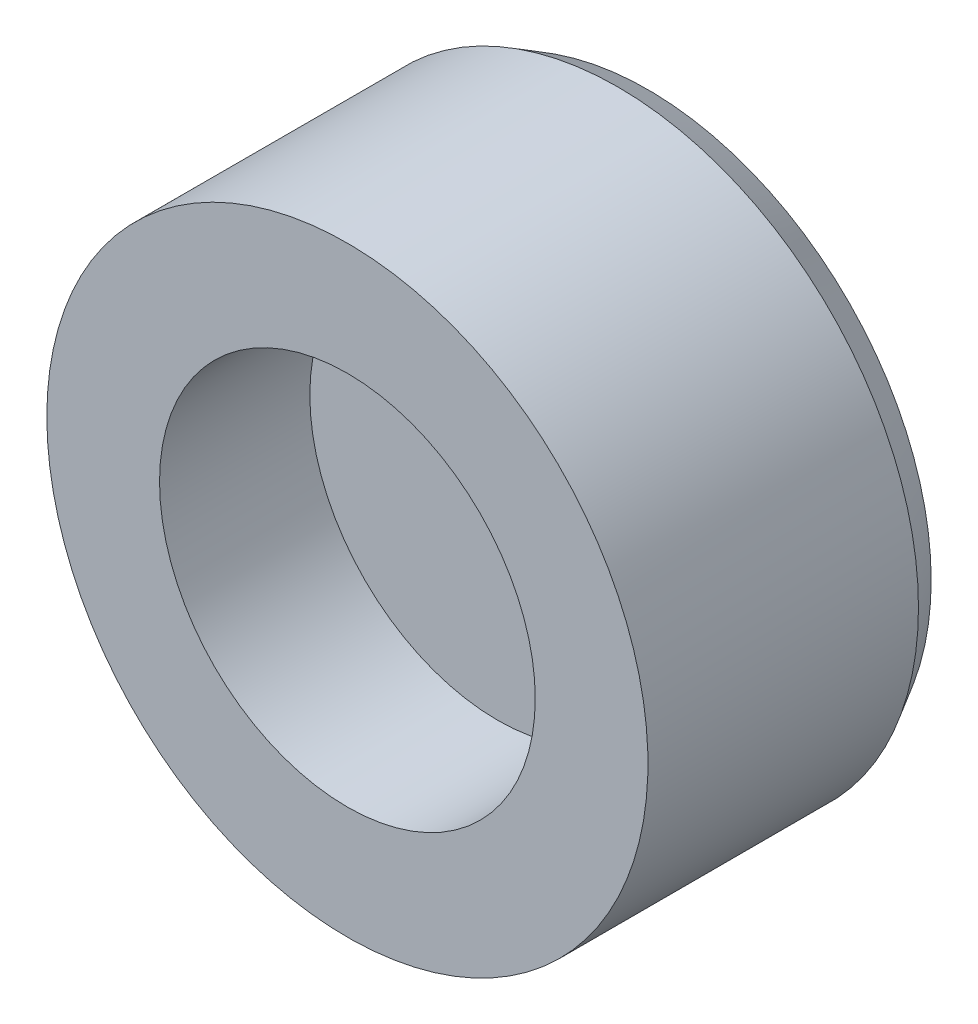
ISO-10303-21;
HEADER;
FILE_DESCRIPTION(('STEP AP214'),'2;1');
FILE_NAME('part.step','',(''),(''),'','','');
FILE_SCHEMA(('AUTOMOTIVE_DESIGN { 1 0 10303 214 1 1 1 1 }'));
ENDSEC;
DATA;
#1=APPLICATION_CONTEXT('core data for automotive mechanical design processes');
#2=APPLICATION_PROTOCOL_DEFINITION('international standard','automotive_design',2000,#1);
#3=PRODUCT_CONTEXT('',#1,'mechanical');
#4=PRODUCT('Part','Part','',(#3));
#5=PRODUCT_RELATED_PRODUCT_CATEGORY('part','',(#4));
#6=PRODUCT_DEFINITION_FORMATION('','',#4);
#7=PRODUCT_DEFINITION_CONTEXT('part definition',#1,'design');
#8=PRODUCT_DEFINITION('design','',#6,#7);
#9=PRODUCT_DEFINITION_SHAPE('','',#8);
#10=(LENGTH_UNIT() NAMED_UNIT(*) SI_UNIT(.MILLI.,.METRE.));
#11=(NAMED_UNIT(*) PLANE_ANGLE_UNIT() SI_UNIT($,.RADIAN.));
#12=(NAMED_UNIT(*) SI_UNIT($,.STERADIAN.) SOLID_ANGLE_UNIT());
#13=UNCERTAINTY_MEASURE_WITH_UNIT(LENGTH_MEASURE(1.E-05),#10,'distance_accuracy_value','');
#14=(GEOMETRIC_REPRESENTATION_CONTEXT(3) GLOBAL_UNCERTAINTY_ASSIGNED_CONTEXT((#13)) GLOBAL_UNIT_ASSIGNED_CONTEXT((#10,
#11,#12)) REPRESENTATION_CONTEXT('',''));
#15=CARTESIAN_POINT('',(0.,0.,0.));
#16=DIRECTION('',(0.,0.,1.));
#17=DIRECTION('',(1.,0.,0.));
#18=AXIS2_PLACEMENT_3D('',#15,#16,#17);
#19=CARTESIAN_POINT('',(0.,0.,2.));
#20=DIRECTION('',(0.,0.,-1.));
#21=DIRECTION('',(-1.,0.,0.));
#22=AXIS2_PLACEMENT_3D('',#19,#20,#21);
#23=PLANE('',#22);
#24=CARTESIAN_POINT('',(0.,0.,2.));
#25=DIRECTION('',(0.,0.,1.));
#26=DIRECTION('',(1.,0.,0.));
#27=AXIS2_PLACEMENT_3D('',#24,#25,#26);
#28=CIRCLE('',#27,2.5);
#29=CARTESIAN_POINT('',(2.5,0.,2.));
#30=VERTEX_POINT('',#29);
#31=EDGE_CURVE('E50',#30,#30,#28,.T.);
#32=ORIENTED_EDGE('',*,*,#31,.F.);
#33=EDGE_LOOP('',(#32));
#34=FACE_BOUND('',#33,.T.);
#35=CARTESIAN_POINT('',(0.,0.,2.));
#36=DIRECTION('',(0.,0.,-1.));
#37=DIRECTION('',(-1.,0.,0.));
#38=AXIS2_PLACEMENT_3D('',#35,#36,#37);
#39=CIRCLE('',#38,4.00000000000002);
#40=CARTESIAN_POINT('',(-4.00000000000002,0.,2.));
#41=VERTEX_POINT('',#40);
#42=EDGE_CURVE('E43',#41,#41,#39,.T.);
#43=ORIENTED_EDGE('',*,*,#42,.F.);
#44=EDGE_LOOP('',(#43));
#45=FACE_BOUND('',#44,.T.);
#46=ADVANCED_FACE('F32',(#34,#45),#23,.F.);
#47=CARTESIAN_POINT('',(0.,0.,-141.429107981221));
#48=DIRECTION('',(0.,0.,-1.));
#49=DIRECTION('',(-1.,0.,0.));
#50=AXIS2_PLACEMENT_3D('',#47,#48,#49);
#51=CYLINDRICAL_SURFACE('',#50,4.00000000000002);
#52=CARTESIAN_POINT('',(0.,0.,-1.59999999999999));
#53=DIRECTION('',(0.,0.,1.));
#54=DIRECTION('',(1.,0.,0.));
#55=AXIS2_PLACEMENT_3D('',#52,#53,#54);
#56=CIRCLE('',#55,4.00000000000002);
#57=CARTESIAN_POINT('',(4.00000000000002,0.,-1.59999999999999));
#58=VERTEX_POINT('',#57);
#59=EDGE_CURVE('E10',#58,#58,#56,.T.);
#60=ORIENTED_EDGE('',*,*,#59,.T.);
#61=EDGE_LOOP('',(#60));
#62=FACE_BOUND('',#61,.T.);
#63=ORIENTED_EDGE('',*,*,#42,.T.);
#64=EDGE_LOOP('',(#63));
#65=FACE_BOUND('',#64,.T.);
#66=ADVANCED_FACE('F66',(#62,#65),#51,.T.);
#67=CARTESIAN_POINT('',(4.00000000000002,0.,-2.));
#68=DIRECTION('',(0.,0.,1.));
#69=DIRECTION('',(1.,0.,0.));
#70=AXIS2_PLACEMENT_3D('',#67,#68,#69);
#71=PLANE('',#70);
#72=CARTESIAN_POINT('',(0.,0.,-2.));
#73=DIRECTION('',(0.,0.,1.));
#74=DIRECTION('',(1.,0.,0.));
#75=AXIS2_PLACEMENT_3D('',#72,#73,#74);
#76=CIRCLE('',#75,3.76905989232417);
#77=CARTESIAN_POINT('',(3.76905989232417,0.,-2.));
#78=VERTEX_POINT('',#77);
#79=EDGE_CURVE('E39',#78,#78,#76,.F.);
#80=ORIENTED_EDGE('',*,*,#79,.T.);
#81=EDGE_LOOP('',(#80));
#82=FACE_BOUND('',#81,.T.);
#83=ADVANCED_FACE('F70',(#82),#71,.F.);
#84=CARTESIAN_POINT('',(0.,0.,-2.));
#85=DIRECTION('',(0.,0.,1.));
#86=DIRECTION('',(1.,0.,0.));
#87=AXIS2_PLACEMENT_3D('',#84,#85,#86);
#88=CONICAL_SURFACE('',#87,3.76905989232417,0.523598775598279);
#89=ORIENTED_EDGE('',*,*,#59,.F.);
#90=EDGE_LOOP('',(#89));
#91=FACE_BOUND('',#90,.T.);
#92=ORIENTED_EDGE('',*,*,#79,.F.);
#93=EDGE_LOOP('',(#92));
#94=FACE_BOUND('',#93,.T.);
#95=ADVANCED_FACE('F34',(#91,#94),#88,.T.);
#96=CARTESIAN_POINT('',(0.,0.,0.));
#97=DIRECTION('',(0.,0.,1.));
#98=DIRECTION('',(1.,0.,0.));
#99=AXIS2_PLACEMENT_3D('',#96,#97,#98);
#100=CYLINDRICAL_SURFACE('',#99,2.5);
#101=CARTESIAN_POINT('',(0.,0.,0.));
#102=DIRECTION('',(0.,0.,1.));
#103=DIRECTION('',(1.,0.,0.));
#104=AXIS2_PLACEMENT_3D('',#101,#102,#103);
#105=CIRCLE('',#104,2.5);
#106=CARTESIAN_POINT('',(2.5,0.,0.));
#107=VERTEX_POINT('',#106);
#108=EDGE_CURVE('E47',#107,#107,#105,.T.);
#109=ORIENTED_EDGE('',*,*,#108,.F.);
#110=EDGE_LOOP('',(#109));
#111=FACE_BOUND('',#110,.T.);
#112=ORIENTED_EDGE('',*,*,#31,.T.);
#113=EDGE_LOOP('',(#112));
#114=FACE_BOUND('',#113,.T.);
#115=ADVANCED_FACE('F58',(#111,#114),#100,.F.);
#116=CARTESIAN_POINT('',(0.,0.,0.));
#117=DIRECTION('',(0.,0.,1.));
#118=DIRECTION('',(1.,0.,0.));
#119=AXIS2_PLACEMENT_3D('',#116,#117,#118);
#120=PLANE('',#119);
#121=ORIENTED_EDGE('',*,*,#108,.T.);
#122=EDGE_LOOP('',(#121));
#123=FACE_BOUND('',#122,.T.);
#124=ADVANCED_FACE('F56',(#123),#120,.T.);
#125=CLOSED_SHELL('',(#46,#66,#83,#95,#115,#124));
#126=MANIFOLD_SOLID_BREP('B2',#125);
#127=ADVANCED_BREP_SHAPE_REPRESENTATION('',(#18,#126),#14);
#128=SHAPE_DEFINITION_REPRESENTATION(#9,#127);
ENDSEC;
END-ISO-10303-21;
